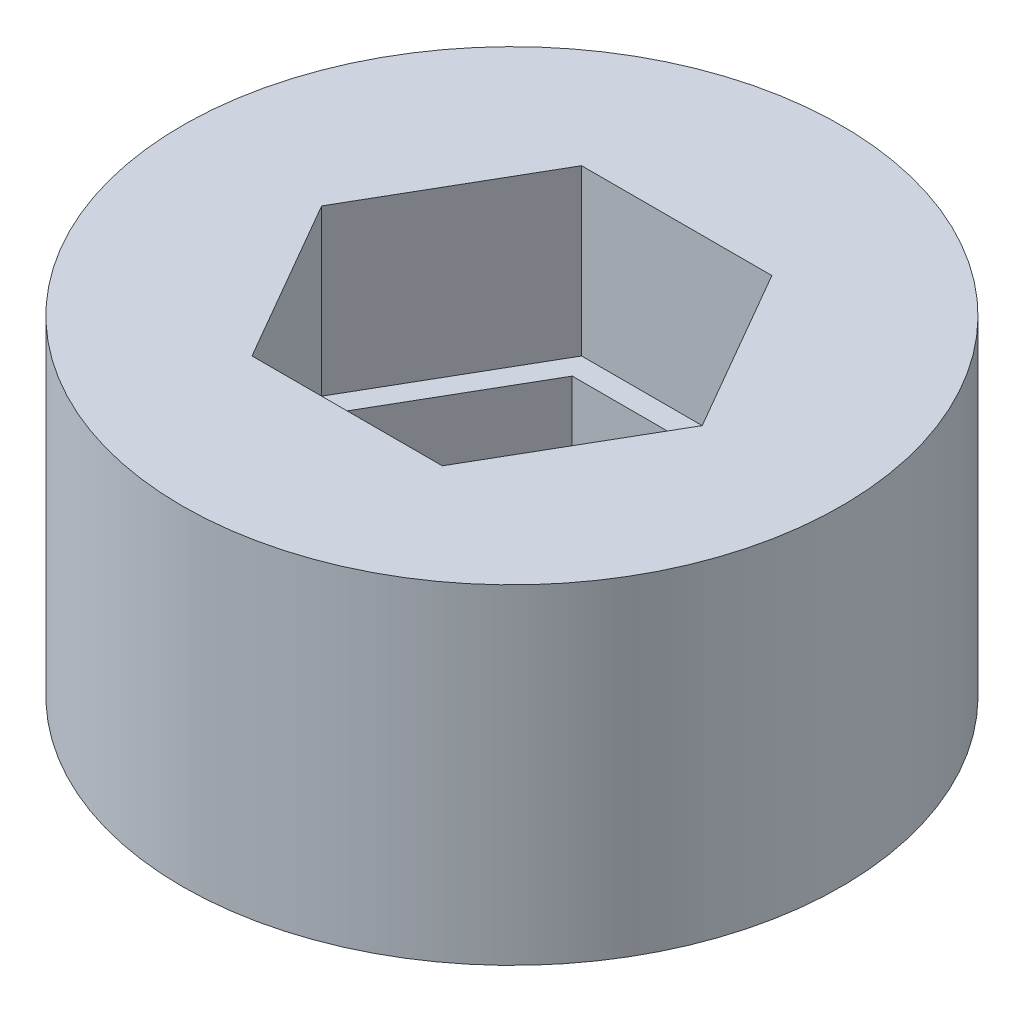
ISO-10303-21;
HEADER;
FILE_DESCRIPTION(('STEP AP214'),'2;1');
FILE_NAME('part.step','',(''),(''),'','','');
FILE_SCHEMA(('AUTOMOTIVE_DESIGN { 1 0 10303 214 1 1 1 1 }'));
ENDSEC;
DATA;
#1=APPLICATION_CONTEXT('core data for automotive mechanical design processes');
#2=APPLICATION_PROTOCOL_DEFINITION('international standard','automotive_design',2000,#1);
#3=PRODUCT_CONTEXT('',#1,'mechanical');
#4=PRODUCT('Part','Part','',(#3));
#5=PRODUCT_RELATED_PRODUCT_CATEGORY('part','',(#4));
#6=PRODUCT_DEFINITION_FORMATION('','',#4);
#7=PRODUCT_DEFINITION_CONTEXT('part definition',#1,'design');
#8=PRODUCT_DEFINITION('design','',#6,#7);
#9=PRODUCT_DEFINITION_SHAPE('','',#8);
#10=(LENGTH_UNIT() NAMED_UNIT(*) SI_UNIT(.MILLI.,.METRE.));
#11=(NAMED_UNIT(*) PLANE_ANGLE_UNIT() SI_UNIT($,.RADIAN.));
#12=(NAMED_UNIT(*) SI_UNIT($,.STERADIAN.) SOLID_ANGLE_UNIT());
#13=UNCERTAINTY_MEASURE_WITH_UNIT(LENGTH_MEASURE(1.E-05),#10,'distance_accuracy_value','');
#14=(GEOMETRIC_REPRESENTATION_CONTEXT(3) GLOBAL_UNCERTAINTY_ASSIGNED_CONTEXT((#13)) GLOBAL_UNIT_ASSIGNED_CONTEXT((#10,
#11,#12)) REPRESENTATION_CONTEXT('',''));
#15=CARTESIAN_POINT('',(0.,0.,0.));
#16=DIRECTION('',(0.,0.,1.));
#17=DIRECTION('',(1.,0.,0.));
#18=AXIS2_PLACEMENT_3D('',#15,#16,#17);
#19=CARTESIAN_POINT('',(0.,3.175,0.));
#20=DIRECTION('',(0.,1.,0.));
#21=DIRECTION('',(0.,0.,1.));
#22=AXIS2_PLACEMENT_3D('',#19,#20,#21);
#23=PLANE('',#22);
#24=DIRECTION('',(-1.,0.,0.));
#25=VECTOR('',#24,1.);
#26=CARTESIAN_POINT('',(1.5875,3.175,-2.74963065701559));
#27=LINE('',#26,#25);
#28=CARTESIAN_POINT('',(1.5875,3.175,-2.74963065701559));
#29=VERTEX_POINT('',#28);
#30=CARTESIAN_POINT('',(-1.5875,3.175,-2.74963065701559));
#31=VERTEX_POINT('',#30);
#32=EDGE_CURVE('E183',#29,#31,#27,.T.);
#33=ORIENTED_EDGE('',*,*,#32,.F.);
#34=DIRECTION('',(-0.5,0.,-0.866025403784439));
#35=VECTOR('',#34,1.);
#36=CARTESIAN_POINT('',(3.175,3.175,0.));
#37=LINE('',#36,#35);
#38=CARTESIAN_POINT('',(3.175,3.175,0.));
#39=VERTEX_POINT('',#38);
#40=EDGE_CURVE('E181',#39,#29,#37,.T.);
#41=ORIENTED_EDGE('',*,*,#40,.F.);
#42=DIRECTION('',(0.5,0.,-0.866025403784439));
#43=VECTOR('',#42,1.);
#44=CARTESIAN_POINT('',(1.5875,3.175,2.74963065701559));
#45=LINE('',#44,#43);
#46=CARTESIAN_POINT('',(1.5875,3.175,2.74963065701559));
#47=VERTEX_POINT('',#46);
#48=EDGE_CURVE('E192',#47,#39,#45,.T.);
#49=ORIENTED_EDGE('',*,*,#48,.F.);
#50=DIRECTION('',(1.,0.,0.));
#51=VECTOR('',#50,1.);
#52=CARTESIAN_POINT('',(-1.5875,3.175,2.74963065701559));
#53=LINE('',#52,#51);
#54=CARTESIAN_POINT('',(-1.5875,3.175,2.74963065701559));
#55=VERTEX_POINT('',#54);
#56=EDGE_CURVE('E190',#55,#47,#53,.T.);
#57=ORIENTED_EDGE('',*,*,#56,.F.);
#58=DIRECTION('',(0.5,0.,0.866025403784439));
#59=VECTOR('',#58,1.);
#60=CARTESIAN_POINT('',(-3.175,3.175,0.));
#61=LINE('',#60,#59);
#62=CARTESIAN_POINT('',(-3.175,3.175,0.));
#63=VERTEX_POINT('',#62);
#64=EDGE_CURVE('E188',#63,#55,#61,.T.);
#65=ORIENTED_EDGE('',*,*,#64,.F.);
#66=DIRECTION('',(-0.5,0.,0.866025403784439));
#67=VECTOR('',#66,1.);
#68=CARTESIAN_POINT('',(-1.5875,3.175,-2.74963065701559));
#69=LINE('',#68,#67);
#70=EDGE_CURVE('E186',#31,#63,#69,.T.);
#71=ORIENTED_EDGE('',*,*,#70,.F.);
#72=EDGE_LOOP('',(#33,#41,#49,#57,#65,#71));
#73=FACE_BOUND('',#72,.T.);
#74=DIRECTION('',(0.5,0.,-0.866025403784439));
#75=VECTOR('',#74,1.);
#76=CARTESIAN_POINT('',(1.83308710467706,3.175,3.175));
#77=LINE('',#76,#75);
#78=CARTESIAN_POINT('',(1.83308710467706,3.175,3.175));
#79=VERTEX_POINT('',#78);
#80=CARTESIAN_POINT('',(3.66617420935412,3.175,0.));
#81=VERTEX_POINT('',#80);
#82=EDGE_CURVE('E132',#79,#81,#77,.T.);
#83=ORIENTED_EDGE('',*,*,#82,.T.);
#84=DIRECTION('',(-0.5,0.,-0.866025403784438));
#85=VECTOR('',#84,1.);
#86=CARTESIAN_POINT('',(3.66617420935412,3.175,0.));
#87=LINE('',#86,#85);
#88=CARTESIAN_POINT('',(1.83308710467706,3.175,-3.175));
#89=VERTEX_POINT('',#88);
#90=EDGE_CURVE('E156',#81,#89,#87,.T.);
#91=ORIENTED_EDGE('',*,*,#90,.T.);
#92=DIRECTION('',(-1.,0.,0.));
#93=VECTOR('',#92,1.);
#94=CARTESIAN_POINT('',(1.83308710467706,3.175,-3.175));
#95=LINE('',#94,#93);
#96=CARTESIAN_POINT('',(-1.83308710467706,3.175,-3.175));
#97=VERTEX_POINT('',#96);
#98=EDGE_CURVE('E138',#89,#97,#95,.T.);
#99=ORIENTED_EDGE('',*,*,#98,.T.);
#100=DIRECTION('',(-0.5,0.,0.866025403784439));
#101=VECTOR('',#100,1.);
#102=CARTESIAN_POINT('',(-1.83308710467706,3.175,-3.175));
#103=LINE('',#102,#101);
#104=CARTESIAN_POINT('',(-3.66617420935412,3.175,0.));
#105=VERTEX_POINT('',#104);
#106=EDGE_CURVE('E159',#97,#105,#103,.T.);
#107=ORIENTED_EDGE('',*,*,#106,.T.);
#108=DIRECTION('',(0.5,0.,0.866025403784438));
#109=VECTOR('',#108,1.);
#110=CARTESIAN_POINT('',(-3.66617420935412,3.175,0.));
#111=LINE('',#110,#109);
#112=CARTESIAN_POINT('',(-1.83308710467706,3.175,3.175));
#113=VERTEX_POINT('',#112);
#114=EDGE_CURVE('E162',#105,#113,#111,.T.);
#115=ORIENTED_EDGE('',*,*,#114,.T.);
#116=DIRECTION('',(1.,0.,0.));
#117=VECTOR('',#116,1.);
#118=CARTESIAN_POINT('',(-1.83308710467706,3.175,3.175));
#119=LINE('',#118,#117);
#120=EDGE_CURVE('E165',#113,#79,#119,.T.);
#121=ORIENTED_EDGE('',*,*,#120,.T.);
#122=EDGE_LOOP('',(#83,#91,#99,#107,#115,#121));
#123=FACE_BOUND('',#122,.T.);
#124=ADVANCED_FACE('F33',(#73,#123),#23,.T.);
#125=CARTESIAN_POINT('',(0.,0.,0.));
#126=DIRECTION('',(0.,1.,0.));
#127=DIRECTION('',(0.,0.,1.));
#128=AXIS2_PLACEMENT_3D('',#125,#126,#127);
#129=PLANE('',#128);
#130=CARTESIAN_POINT('',(0.,0.,0.));
#131=DIRECTION('',(0.,1.,0.));
#132=DIRECTION('',(0.,0.,1.));
#133=AXIS2_PLACEMENT_3D('',#130,#131,#132);
#134=CIRCLE('',#133,6.35);
#135=CARTESIAN_POINT('',(0.,0.,6.35));
#136=VERTEX_POINT('',#135);
#137=EDGE_CURVE('E11',#136,#136,#134,.T.);
#138=ORIENTED_EDGE('',*,*,#137,.F.);
#139=EDGE_LOOP('',(#138));
#140=FACE_BOUND('',#139,.T.);
#141=DIRECTION('',(-0.5,0.,-0.866025403784439));
#142=VECTOR('',#141,1.);
#143=CARTESIAN_POINT('',(3.175,0.,0.));
#144=LINE('',#143,#142);
#145=CARTESIAN_POINT('',(3.175,0.,0.));
#146=VERTEX_POINT('',#145);
#147=CARTESIAN_POINT('',(1.5875,0.,-2.74963065701559));
#148=VERTEX_POINT('',#147);
#149=EDGE_CURVE('E180',#146,#148,#144,.T.);
#150=ORIENTED_EDGE('',*,*,#149,.T.);
#151=DIRECTION('',(-1.,0.,0.));
#152=VECTOR('',#151,1.);
#153=CARTESIAN_POINT('',(1.5875,0.,-2.74963065701559));
#154=LINE('',#153,#152);
#155=CARTESIAN_POINT('',(-1.5875,0.,-2.74963065701559));
#156=VERTEX_POINT('',#155);
#157=EDGE_CURVE('E197',#148,#156,#154,.T.);
#158=ORIENTED_EDGE('',*,*,#157,.T.);
#159=DIRECTION('',(-0.5,0.,0.866025403784439));
#160=VECTOR('',#159,1.);
#161=CARTESIAN_POINT('',(-1.5875,0.,-2.74963065701559));
#162=LINE('',#161,#160);
#163=CARTESIAN_POINT('',(-3.175,0.,0.));
#164=VERTEX_POINT('',#163);
#165=EDGE_CURVE('E200',#156,#164,#162,.T.);
#166=ORIENTED_EDGE('',*,*,#165,.T.);
#167=DIRECTION('',(0.5,0.,0.866025403784439));
#168=VECTOR('',#167,1.);
#169=CARTESIAN_POINT('',(-3.175,0.,0.));
#170=LINE('',#169,#168);
#171=CARTESIAN_POINT('',(-1.5875,0.,2.74963065701559));
#172=VERTEX_POINT('',#171);
#173=EDGE_CURVE('E203',#164,#172,#170,.T.);
#174=ORIENTED_EDGE('',*,*,#173,.T.);
#175=DIRECTION('',(1.,0.,0.));
#176=VECTOR('',#175,1.);
#177=CARTESIAN_POINT('',(-1.5875,0.,2.74963065701559));
#178=LINE('',#177,#176);
#179=CARTESIAN_POINT('',(1.5875,0.,2.74963065701559));
#180=VERTEX_POINT('',#179);
#181=EDGE_CURVE('E206',#172,#180,#178,.T.);
#182=ORIENTED_EDGE('',*,*,#181,.T.);
#183=DIRECTION('',(0.5,0.,-0.866025403784439));
#184=VECTOR('',#183,1.);
#185=CARTESIAN_POINT('',(1.5875,0.,2.74963065701559));
#186=LINE('',#185,#184);
#187=EDGE_CURVE('E184',#180,#146,#186,.T.);
#188=ORIENTED_EDGE('',*,*,#187,.T.);
#189=EDGE_LOOP('',(#150,#158,#166,#174,#182,#188));
#190=FACE_BOUND('',#189,.T.);
#191=ADVANCED_FACE('F228',(#140,#190),#129,.F.);
#192=CARTESIAN_POINT('',(0.,3.175,0.));
#193=DIRECTION('',(0.,-1.,0.));
#194=DIRECTION('',(0.,0.,-1.));
#195=AXIS2_PLACEMENT_3D('',#192,#193,#194);
#196=CYLINDRICAL_SURFACE('',#195,6.35);
#197=ORIENTED_EDGE('',*,*,#137,.T.);
#198=EDGE_LOOP('',(#197));
#199=FACE_BOUND('',#198,.T.);
#200=CARTESIAN_POINT('',(0.,6.35,0.));
#201=DIRECTION('',(0.,1.,0.));
#202=DIRECTION('',(0.,0.,1.));
#203=AXIS2_PLACEMENT_3D('',#200,#201,#202);
#204=CIRCLE('',#203,6.35);
#205=CARTESIAN_POINT('',(0.,6.35,6.35));
#206=VERTEX_POINT('',#205);
#207=EDGE_CURVE('E139',#206,#206,#204,.T.);
#208=ORIENTED_EDGE('',*,*,#207,.F.);
#209=EDGE_LOOP('',(#208));
#210=FACE_BOUND('',#209,.T.);
#211=ADVANCED_FACE('F35',(#199,#210),#196,.T.);
#212=CARTESIAN_POINT('',(3.175,3.175,0.));
#213=DIRECTION('',(-0.866025403784439,0.,0.5));
#214=DIRECTION('',(0.5,0.,0.866025403784439));
#215=AXIS2_PLACEMENT_3D('',#212,#213,#214);
#216=PLANE('',#215);
#217=ORIENTED_EDGE('',*,*,#149,.F.);
#218=DIRECTION('',(0.,-1.,0.));
#219=VECTOR('',#218,1.);
#220=CARTESIAN_POINT('',(3.175,3.175,0.));
#221=LINE('',#220,#219);
#222=EDGE_CURVE('E194',#39,#146,#221,.T.);
#223=ORIENTED_EDGE('',*,*,#222,.F.);
#224=ORIENTED_EDGE('',*,*,#40,.T.);
#225=DIRECTION('',(0.,-1.,0.));
#226=VECTOR('',#225,1.);
#227=CARTESIAN_POINT('',(1.5875,3.175,-2.74963065701559));
#228=LINE('',#227,#226);
#229=EDGE_CURVE('E41',#29,#148,#228,.T.);
#230=ORIENTED_EDGE('',*,*,#229,.T.);
#231=EDGE_LOOP('',(#217,#223,#224,#230));
#232=FACE_BOUND('',#231,.T.);
#233=ADVANCED_FACE('F222',(#232),#216,.T.);
#234=CARTESIAN_POINT('',(1.5875,3.175,-2.74963065701559));
#235=DIRECTION('',(0.,0.,1.));
#236=DIRECTION('',(1.,0.,0.));
#237=AXIS2_PLACEMENT_3D('',#234,#235,#236);
#238=PLANE('',#237);
#239=ORIENTED_EDGE('',*,*,#157,.F.);
#240=ORIENTED_EDGE('',*,*,#229,.F.);
#241=ORIENTED_EDGE('',*,*,#32,.T.);
#242=DIRECTION('',(0.,-1.,0.));
#243=VECTOR('',#242,1.);
#244=CARTESIAN_POINT('',(-1.5875,3.175,-2.74963065701559));
#245=LINE('',#244,#243);
#246=EDGE_CURVE('E218',#31,#156,#245,.T.);
#247=ORIENTED_EDGE('',*,*,#246,.T.);
#248=EDGE_LOOP('',(#239,#240,#241,#247));
#249=FACE_BOUND('',#248,.T.);
#250=ADVANCED_FACE('F238',(#249),#238,.T.);
#251=CARTESIAN_POINT('',(-1.5875,3.175,-2.74963065701559));
#252=DIRECTION('',(0.866025403784439,0.,0.5));
#253=DIRECTION('',(0.5,0.,-0.866025403784439));
#254=AXIS2_PLACEMENT_3D('',#251,#252,#253);
#255=PLANE('',#254);
#256=ORIENTED_EDGE('',*,*,#165,.F.);
#257=ORIENTED_EDGE('',*,*,#246,.F.);
#258=ORIENTED_EDGE('',*,*,#70,.T.);
#259=DIRECTION('',(0.,-1.,0.));
#260=VECTOR('',#259,1.);
#261=CARTESIAN_POINT('',(-3.175,3.175,0.));
#262=LINE('',#261,#260);
#263=EDGE_CURVE('E216',#63,#164,#262,.T.);
#264=ORIENTED_EDGE('',*,*,#263,.T.);
#265=EDGE_LOOP('',(#256,#257,#258,#264));
#266=FACE_BOUND('',#265,.T.);
#267=ADVANCED_FACE('F241',(#266),#255,.T.);
#268=CARTESIAN_POINT('',(-3.175,3.175,0.));
#269=DIRECTION('',(0.866025403784439,0.,-0.5));
#270=DIRECTION('',(-0.5,0.,-0.866025403784439));
#271=AXIS2_PLACEMENT_3D('',#268,#269,#270);
#272=PLANE('',#271);
#273=ORIENTED_EDGE('',*,*,#173,.F.);
#274=ORIENTED_EDGE('',*,*,#263,.F.);
#275=ORIENTED_EDGE('',*,*,#64,.T.);
#276=DIRECTION('',(0.,-1.,0.));
#277=VECTOR('',#276,1.);
#278=CARTESIAN_POINT('',(-1.5875,3.175,2.74963065701559));
#279=LINE('',#278,#277);
#280=EDGE_CURVE('E214',#55,#172,#279,.T.);
#281=ORIENTED_EDGE('',*,*,#280,.T.);
#282=EDGE_LOOP('',(#273,#274,#275,#281));
#283=FACE_BOUND('',#282,.T.);
#284=ADVANCED_FACE('F245',(#283),#272,.T.);
#285=CARTESIAN_POINT('',(-1.5875,3.175,2.74963065701559));
#286=DIRECTION('',(0.,0.,-1.));
#287=DIRECTION('',(-1.,0.,0.));
#288=AXIS2_PLACEMENT_3D('',#285,#286,#287);
#289=PLANE('',#288);
#290=ORIENTED_EDGE('',*,*,#181,.F.);
#291=ORIENTED_EDGE('',*,*,#280,.F.);
#292=ORIENTED_EDGE('',*,*,#56,.T.);
#293=DIRECTION('',(0.,-1.,0.));
#294=VECTOR('',#293,1.);
#295=CARTESIAN_POINT('',(1.5875,3.175,2.74963065701559));
#296=LINE('',#295,#294);
#297=EDGE_CURVE('E56',#47,#180,#296,.T.);
#298=ORIENTED_EDGE('',*,*,#297,.T.);
#299=EDGE_LOOP('',(#290,#291,#292,#298));
#300=FACE_BOUND('',#299,.T.);
#301=ADVANCED_FACE('F248',(#300),#289,.T.);
#302=CARTESIAN_POINT('',(1.5875,3.175,2.74963065701559));
#303=DIRECTION('',(-0.866025403784439,0.,-0.5));
#304=DIRECTION('',(-0.5,0.,0.866025403784439));
#305=AXIS2_PLACEMENT_3D('',#302,#303,#304);
#306=PLANE('',#305);
#307=ORIENTED_EDGE('',*,*,#187,.F.);
#308=ORIENTED_EDGE('',*,*,#297,.F.);
#309=ORIENTED_EDGE('',*,*,#48,.T.);
#310=ORIENTED_EDGE('',*,*,#222,.T.);
#311=EDGE_LOOP('',(#307,#308,#309,#310));
#312=FACE_BOUND('',#311,.T.);
#313=ADVANCED_FACE('F230',(#312),#306,.T.);
#314=CARTESIAN_POINT('',(0.,6.35,0.));
#315=DIRECTION('',(0.,1.,0.));
#316=DIRECTION('',(0.,0.,1.));
#317=AXIS2_PLACEMENT_3D('',#314,#315,#316);
#318=PLANE('',#317);
#319=ORIENTED_EDGE('',*,*,#207,.T.);
#320=EDGE_LOOP('',(#319));
#321=FACE_BOUND('',#320,.T.);
#322=DIRECTION('',(-1.,0.,0.));
#323=VECTOR('',#322,1.);
#324=CARTESIAN_POINT('',(1.83308710467706,6.35,-3.175));
#325=LINE('',#324,#323);
#326=CARTESIAN_POINT('',(1.83308710467706,6.35,-3.175));
#327=VERTEX_POINT('',#326);
#328=CARTESIAN_POINT('',(-1.83308710467706,6.35,-3.175));
#329=VERTEX_POINT('',#328);
#330=EDGE_CURVE('E131',#327,#329,#325,.T.);
#331=ORIENTED_EDGE('',*,*,#330,.F.);
#332=DIRECTION('',(-0.5,0.,-0.866025403784438));
#333=VECTOR('',#332,1.);
#334=CARTESIAN_POINT('',(3.66617420935412,6.35,0.));
#335=LINE('',#334,#333);
#336=CARTESIAN_POINT('',(3.66617420935412,6.35,0.));
#337=VERTEX_POINT('',#336);
#338=EDGE_CURVE('E123',#337,#327,#335,.T.);
#339=ORIENTED_EDGE('',*,*,#338,.F.);
#340=DIRECTION('',(0.5,0.,-0.866025403784439));
#341=VECTOR('',#340,1.);
#342=CARTESIAN_POINT('',(1.83308710467706,6.35,3.175));
#343=LINE('',#342,#341);
#344=CARTESIAN_POINT('',(1.83308710467706,6.35,3.175));
#345=VERTEX_POINT('',#344);
#346=EDGE_CURVE('E154',#345,#337,#343,.T.);
#347=ORIENTED_EDGE('',*,*,#346,.F.);
#348=DIRECTION('',(1.,0.,0.));
#349=VECTOR('',#348,1.);
#350=CARTESIAN_POINT('',(-1.83308710467706,6.35,3.175));
#351=LINE('',#350,#349);
#352=CARTESIAN_POINT('',(-1.83308710467706,6.35,3.175));
#353=VERTEX_POINT('',#352);
#354=EDGE_CURVE('E151',#353,#345,#351,.T.);
#355=ORIENTED_EDGE('',*,*,#354,.F.);
#356=DIRECTION('',(0.5,0.,0.866025403784438));
#357=VECTOR('',#356,1.);
#358=CARTESIAN_POINT('',(-3.66617420935412,6.35,0.));
#359=LINE('',#358,#357);
#360=CARTESIAN_POINT('',(-3.66617420935412,6.35,0.));
#361=VERTEX_POINT('',#360);
#362=EDGE_CURVE('E147',#361,#353,#359,.T.);
#363=ORIENTED_EDGE('',*,*,#362,.F.);
#364=DIRECTION('',(-0.5,0.,0.866025403784439));
#365=VECTOR('',#364,1.);
#366=CARTESIAN_POINT('',(-1.83308710467706,6.35,-3.175));
#367=LINE('',#366,#365);
#368=EDGE_CURVE('E145',#329,#361,#367,.T.);
#369=ORIENTED_EDGE('',*,*,#368,.F.);
#370=EDGE_LOOP('',(#331,#339,#347,#355,#363,#369));
#371=FACE_BOUND('',#370,.T.);
#372=ADVANCED_FACE('F143',(#321,#371),#318,.T.);
#373=CARTESIAN_POINT('',(3.66617420935412,6.35,0.));
#374=DIRECTION('',(-0.866025403784438,0.,0.5));
#375=DIRECTION('',(0.5,0.,0.866025403784438));
#376=AXIS2_PLACEMENT_3D('',#373,#374,#375);
#377=PLANE('',#376);
#378=ORIENTED_EDGE('',*,*,#90,.F.);
#379=DIRECTION('',(0.,-1.,0.));
#380=VECTOR('',#379,1.);
#381=CARTESIAN_POINT('',(3.66617420935412,6.35,0.));
#382=LINE('',#381,#380);
#383=EDGE_CURVE('E48',#337,#81,#382,.T.);
#384=ORIENTED_EDGE('',*,*,#383,.F.);
#385=ORIENTED_EDGE('',*,*,#338,.T.);
#386=DIRECTION('',(0.,-1.,0.));
#387=VECTOR('',#386,1.);
#388=CARTESIAN_POINT('',(1.83308710467706,6.35,-3.175));
#389=LINE('',#388,#387);
#390=EDGE_CURVE('E126',#327,#89,#389,.T.);
#391=ORIENTED_EDGE('',*,*,#390,.T.);
#392=EDGE_LOOP('',(#378,#384,#385,#391));
#393=FACE_BOUND('',#392,.T.);
#394=ADVANCED_FACE('F125',(#393),#377,.T.);
#395=CARTESIAN_POINT('',(1.83308710467706,6.35,-3.175));
#396=DIRECTION('',(0.,0.,1.));
#397=DIRECTION('',(1.,0.,0.));
#398=AXIS2_PLACEMENT_3D('',#395,#396,#397);
#399=PLANE('',#398);
#400=ORIENTED_EDGE('',*,*,#98,.F.);
#401=ORIENTED_EDGE('',*,*,#390,.F.);
#402=ORIENTED_EDGE('',*,*,#330,.T.);
#403=DIRECTION('',(0.,-1.,0.));
#404=VECTOR('',#403,1.);
#405=CARTESIAN_POINT('',(-1.83308710467706,6.35,-3.175));
#406=LINE('',#405,#404);
#407=EDGE_CURVE('E140',#329,#97,#406,.T.);
#408=ORIENTED_EDGE('',*,*,#407,.T.);
#409=EDGE_LOOP('',(#400,#401,#402,#408));
#410=FACE_BOUND('',#409,.T.);
#411=ADVANCED_FACE('F135',(#410),#399,.T.);
#412=CARTESIAN_POINT('',(-1.83308710467706,6.35,-3.175));
#413=DIRECTION('',(0.866025403784439,0.,0.5));
#414=DIRECTION('',(0.5,0.,-0.866025403784439));
#415=AXIS2_PLACEMENT_3D('',#412,#413,#414);
#416=PLANE('',#415);
#417=ORIENTED_EDGE('',*,*,#106,.F.);
#418=ORIENTED_EDGE('',*,*,#407,.F.);
#419=ORIENTED_EDGE('',*,*,#368,.T.);
#420=DIRECTION('',(0.,-1.,0.));
#421=VECTOR('',#420,1.);
#422=CARTESIAN_POINT('',(-3.66617420935412,6.35,0.));
#423=LINE('',#422,#421);
#424=EDGE_CURVE('E175',#361,#105,#423,.T.);
#425=ORIENTED_EDGE('',*,*,#424,.T.);
#426=EDGE_LOOP('',(#417,#418,#419,#425));
#427=FACE_BOUND('',#426,.T.);
#428=ADVANCED_FACE('F326',(#427),#416,.T.);
#429=CARTESIAN_POINT('',(-3.66617420935412,6.35,0.));
#430=DIRECTION('',(0.866025403784438,0.,-0.5));
#431=DIRECTION('',(-0.5,0.,-0.866025403784438));
#432=AXIS2_PLACEMENT_3D('',#429,#430,#431);
#433=PLANE('',#432);
#434=ORIENTED_EDGE('',*,*,#114,.F.);
#435=ORIENTED_EDGE('',*,*,#424,.F.);
#436=ORIENTED_EDGE('',*,*,#362,.T.);
#437=DIRECTION('',(0.,-1.,0.));
#438=VECTOR('',#437,1.);
#439=CARTESIAN_POINT('',(-1.83308710467706,6.35,3.175));
#440=LINE('',#439,#438);
#441=EDGE_CURVE('E173',#353,#113,#440,.T.);
#442=ORIENTED_EDGE('',*,*,#441,.T.);
#443=EDGE_LOOP('',(#434,#435,#436,#442));
#444=FACE_BOUND('',#443,.T.);
#445=ADVANCED_FACE('F335',(#444),#433,.T.);
#446=CARTESIAN_POINT('',(-1.83308710467706,6.35,3.175));
#447=DIRECTION('',(0.,0.,-1.));
#448=DIRECTION('',(-1.,0.,0.));
#449=AXIS2_PLACEMENT_3D('',#446,#447,#448);
#450=PLANE('',#449);
#451=ORIENTED_EDGE('',*,*,#120,.F.);
#452=ORIENTED_EDGE('',*,*,#441,.F.);
#453=ORIENTED_EDGE('',*,*,#354,.T.);
#454=DIRECTION('',(0.,-1.,0.));
#455=VECTOR('',#454,1.);
#456=CARTESIAN_POINT('',(1.83308710467706,6.35,3.175));
#457=LINE('',#456,#455);
#458=EDGE_CURVE('E171',#345,#79,#457,.T.);
#459=ORIENTED_EDGE('',*,*,#458,.T.);
#460=EDGE_LOOP('',(#451,#452,#453,#459));
#461=FACE_BOUND('',#460,.T.);
#462=ADVANCED_FACE('F345',(#461),#450,.T.);
#463=CARTESIAN_POINT('',(1.83308710467706,6.35,3.175));
#464=DIRECTION('',(-0.866025403784439,0.,-0.5));
#465=DIRECTION('',(-0.5,0.,0.866025403784439));
#466=AXIS2_PLACEMENT_3D('',#463,#464,#465);
#467=PLANE('',#466);
#468=ORIENTED_EDGE('',*,*,#82,.F.);
#469=ORIENTED_EDGE('',*,*,#458,.F.);
#470=ORIENTED_EDGE('',*,*,#346,.T.);
#471=ORIENTED_EDGE('',*,*,#383,.T.);
#472=EDGE_LOOP('',(#468,#469,#470,#471));
#473=FACE_BOUND('',#472,.T.);
#474=ADVANCED_FACE('F355',(#473),#467,.T.);
#475=CLOSED_SHELL('',(#124,#191,#211,#233,#250,#267,#284,#301,#313,#372,#394,#411,#428,#445,
#462,#474));
#476=MANIFOLD_SOLID_BREP('B2',#475);
#477=ADVANCED_BREP_SHAPE_REPRESENTATION('',(#18,#476),#14);
#478=SHAPE_DEFINITION_REPRESENTATION(#9,#477);
ENDSEC;
END-ISO-10303-21;
